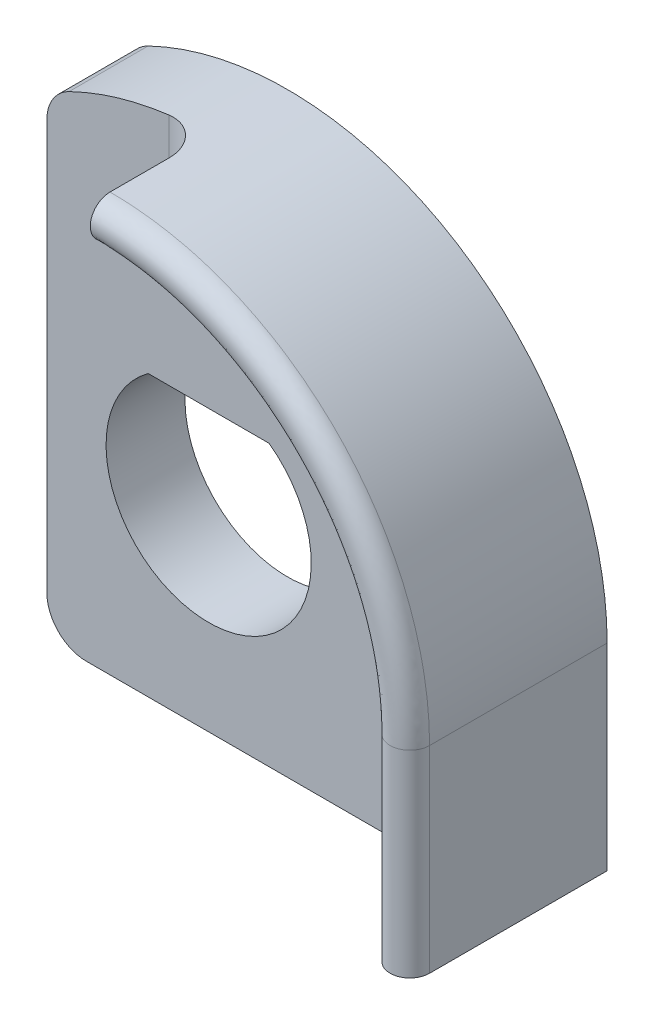
ISO-10303-21;
HEADER;
FILE_DESCRIPTION(('STEP AP214'),'2;1');
FILE_NAME('part.step','',(''),(''),'','','');
FILE_SCHEMA(('AUTOMOTIVE_DESIGN { 1 0 10303 214 1 1 1 1 }'));
ENDSEC;
DATA;
#1=APPLICATION_CONTEXT('core data for automotive mechanical design processes');
#2=APPLICATION_PROTOCOL_DEFINITION('international standard','automotive_design',2000,#1);
#3=PRODUCT_CONTEXT('',#1,'mechanical');
#4=PRODUCT('Part','Part','',(#3));
#5=PRODUCT_RELATED_PRODUCT_CATEGORY('part','',(#4));
#6=PRODUCT_DEFINITION_FORMATION('','',#4);
#7=PRODUCT_DEFINITION_CONTEXT('part definition',#1,'design');
#8=PRODUCT_DEFINITION('design','',#6,#7);
#9=PRODUCT_DEFINITION_SHAPE('','',#8);
#10=(LENGTH_UNIT() NAMED_UNIT(*) SI_UNIT(.MILLI.,.METRE.));
#11=(NAMED_UNIT(*) PLANE_ANGLE_UNIT() SI_UNIT($,.RADIAN.));
#12=(NAMED_UNIT(*) SI_UNIT($,.STERADIAN.) SOLID_ANGLE_UNIT());
#13=UNCERTAINTY_MEASURE_WITH_UNIT(LENGTH_MEASURE(1.E-05),#10,'distance_accuracy_value','');
#14=(GEOMETRIC_REPRESENTATION_CONTEXT(3) GLOBAL_UNCERTAINTY_ASSIGNED_CONTEXT((#13)) GLOBAL_UNIT_ASSIGNED_CONTEXT((#10,
#11,#12)) REPRESENTATION_CONTEXT('',''));
#15=CARTESIAN_POINT('',(0.,0.,0.));
#16=DIRECTION('',(0.,0.,1.));
#17=DIRECTION('',(1.,0.,0.));
#18=AXIS2_PLACEMENT_3D('',#15,#16,#17);
#19=CARTESIAN_POINT('',(7.6,-5.,4.5));
#20=DIRECTION('',(0.,-1.,0.));
#21=DIRECTION('',(0.,0.,-1.));
#22=AXIS2_PLACEMENT_3D('',#19,#20,#21);
#23=CYLINDRICAL_SURFACE('',#22,0.5);
#24=CARTESIAN_POINT('',(7.10000000000001,6.05027027352391E-11,4.49999999999999));
#25=CARTESIAN_POINT('',(7.1,6.05026985607435E-11,4.83333333333332));
#26=CARTESIAN_POINT('',(7.35,6.27418145251573E-11,5.25000000000001));
#27=CARTESIAN_POINT('',(7.85000000000001,6.72200551300588E-11,5.25000000000001));
#28=CARTESIAN_POINT('',(8.10000000000001,6.94591704229849E-11,4.83333333333332));
#29=CARTESIAN_POINT('',(8.1,6.94591670285425E-11,4.49999999999999));
#30=(BOUNDED_CURVE() B_SPLINE_CURVE(5,(#24,#25,#26,#27,#28,#29),.UNSPECIFIED.,.F.,
.F.) B_SPLINE_CURVE_WITH_KNOTS((6,6),(0.,1.),
.UNSPECIFIED.) CURVE() GEOMETRIC_REPRESENTATION_ITEM() RATIONAL_B_SPLINE_CURVE((1.,
0.599999999999993,0.399999999999989,0.399999999999989,0.599999999999993,1.)) REPRESENTATION_ITEM(''));
#31=CARTESIAN_POINT('',(7.1,0.,4.5));
#32=VERTEX_POINT('',#31);
#33=CARTESIAN_POINT('',(8.1,0.,4.5));
#34=VERTEX_POINT('',#33);
#35=EDGE_CURVE('E282',#32,#34,#30,.T.);
#36=ORIENTED_EDGE('',*,*,#35,.F.);
#37=DIRECTION('',(0.,1.,0.));
#38=VECTOR('',#37,1.);
#39=CARTESIAN_POINT('',(7.1,-5.,4.5));
#40=LINE('',#39,#38);
#41=CARTESIAN_POINT('',(7.1,-5.,4.5));
#42=VERTEX_POINT('',#41);
#43=EDGE_CURVE('E197',#42,#32,#40,.T.);
#44=ORIENTED_EDGE('',*,*,#43,.F.);
#45=CARTESIAN_POINT('',(7.6,-5.,4.5));
#46=DIRECTION('',(0.,1.,0.));
#47=DIRECTION('',(0.,0.,1.));
#48=AXIS2_PLACEMENT_3D('',#45,#46,#47);
#49=CIRCLE('',#48,0.5);
#50=CARTESIAN_POINT('',(8.1,-5.,4.5));
#51=VERTEX_POINT('',#50);
#52=EDGE_CURVE('E196',#51,#42,#49,.F.);
#53=ORIENTED_EDGE('',*,*,#52,.F.);
#54=DIRECTION('',(0.,1.,0.));
#55=VECTOR('',#54,1.);
#56=CARTESIAN_POINT('',(8.1,-5.,4.5));
#57=LINE('',#56,#55);
#58=EDGE_CURVE('E193',#34,#51,#57,.F.);
#59=ORIENTED_EDGE('',*,*,#58,.F.);
#60=EDGE_LOOP('',(#36,#44,#53,#59));
#61=FACE_BOUND('',#60,.T.);
#62=ADVANCED_FACE('F38',(#61),#23,.T.);
#63=CARTESIAN_POINT('',(-1.17009575727307,8.01504060618607,4.49754308353227));
#64=CARTESIAN_POINT('',(-0.803731315567237,8.06852523588649,4.49604486390079));
#65=CARTESIAN_POINT('',(-0.427514615194444,8.09999997452948,4.50000000004851));
#66=CARTESIAN_POINT('',(1.06878484894531,8.10000006367625,4.49999999987875));
#67=CARTESIAN_POINT('',(2.12499328446535,7.88746921686769,4.49999998129626));
#68=CARTESIAN_POINT('',(4.07831966162605,7.07778749636161,4.50000001861846));
#69=CARTESIAN_POINT('',(4.97359544530799,6.48153436499398,4.50000000093308));
#70=CARTESIAN_POINT('',(6.48153406867629,4.97359583146588,4.49999999906692));
#71=CARTESIAN_POINT('',(7.07866765627066,4.07690453053062,4.4999999999996));
#72=CARTESIAN_POINT('',(7.8881806780739,2.12256729670818,4.5000000000004));
#73=CARTESIAN_POINT('',(8.1,1.06630263013299,4.4998139233984));
#74=CARTESIAN_POINT('',(8.1,0.,4.5));
#75=CARTESIAN_POINT('',(-1.17009575727307,8.01504060618607,4.83251436117742));
#76=CARTESIAN_POINT('',(-0.802484859657044,8.07082724936822,4.83096012837023));
#77=CARTESIAN_POINT('',(-0.427514615194415,8.09999997706302,4.8333333333495));
#78=CARTESIAN_POINT('',(1.06878484894524,8.1000000573424,4.83333333329292));
#79=CARTESIAN_POINT('',(2.12499328445255,7.8874692168368,4.83333332709916));
#80=CARTESIAN_POINT('',(4.07831966163886,7.0777874963925,4.83333333953908));
#81=CARTESIAN_POINT('',(4.97359547846418,6.48153439815017,4.83333333364409));
#82=CARTESIAN_POINT('',(6.4815340355201,4.97359579830968,4.83333333302258));
#83=CARTESIAN_POINT('',(7.07866765627092,4.07690453053072,4.83333333333333));
#84=CARTESIAN_POINT('',(7.88818067807364,2.12256729670807,4.83333333333333));
#85=CARTESIAN_POINT('',(8.10008271320572,1.06647913005069,4.83321615460348));
#86=CARTESIAN_POINT('',(8.1,0.,4.83333333333333));
#87=CARTESIAN_POINT('',(-1.15694746072875,7.76415644860623,5.25122845823387));
#88=CARTESIAN_POINT('',(-0.786250843680796,7.82192014785471,5.25358159601005));
#89=CARTESIAN_POINT('',(-0.41383589421834,7.84999997721726,5.24999999997559));
#90=CARTESIAN_POINT('',(1.03458809863594,7.8500000569568,5.25000000006103));
#91=CARTESIAN_POINT('',(2.05878617981607,7.64428574443716,5.25000000935187));
#92=CARTESIAN_POINT('',(3.95306084259289,6.85908267048717,5.24999999069077));
#93=CARTESIAN_POINT('',(4.82101719938836,6.28055927150274,5.24999999953407));
#94=CARTESIAN_POINT('',(6.28055893453467,4.82101752383181,5.25000000046594));
#95=CARTESIAN_POINT('',(6.85990406089408,3.95176508824681,5.25000000000081));
#96=CARTESIAN_POINT('',(7.64500451004478,2.05636501592906,5.24999999999919));
#97=CARTESIAN_POINT('',(7.85009306597148,1.03232492322791,5.25012408924923));
#98=CARTESIAN_POINT('',(7.85,0.,5.25));
#99=CARTESIAN_POINT('',(-1.1306508676401,7.26238813344654,5.25122845823387));
#100=CARTESIAN_POINT('',(-0.75686415949416,7.31828435759996,5.25360043641053));
#101=CARTESIAN_POINT('',(-0.386478452266263,7.3499999775251,5.24999999997559));
#102=CARTESIAN_POINT('',(0.966194598017519,7.35000005618723,5.25000000006103));
#103=CARTESIAN_POINT('',(1.92637197054291,7.15791879963908,5.25000000935187));
#104=CARTESIAN_POINT('',(3.70254320450116,6.42167301867529,5.24999999069077));
#105=CARTESIAN_POINT('',(4.51586064123834,5.87860901821068,5.24999999953407));
#106=CARTESIAN_POINT('',(5.8786087325622,4.51586097487326,5.25000000046594));
#107=CARTESIAN_POINT('',(6.4223768701384,3.70148620367958,5.25000000000081));
#108=CARTESIAN_POINT('',(7.15865217398907,1.92396045437044,5.24999999999919));
#109=CARTESIAN_POINT('',(7.34990694587305,0.963575071923958,5.25012407148698));
#110=CARTESIAN_POINT('',(7.35,0.,5.25));
#111=CARTESIAN_POINT('',(-1.11750257109577,7.0115039758667,4.83251436117742));
#112=CARTESIAN_POINT('',(-0.744546077931832,7.06879368173973,4.83093737548443));
#113=CARTESIAN_POINT('',(-0.372799731290261,7.09999997767885,4.8333333333495));
#114=CARTESIAN_POINT('',(0.931997847708399,7.10000005580285,4.83333333329292));
#115=CARTESIAN_POINT('',(1.86016486590644,6.91473532723983,4.83333332709916));
#116=CARTESIAN_POINT('',(3.5772843854552,6.20296819276956,4.83333333953908));
#117=CARTESIAN_POINT('',(4.36328236216293,5.67763389156445,4.83333333364409));
#118=CARTESIAN_POINT('',(5.67763363157637,4.36328270039418,4.83333333302258));
#119=CARTESIAN_POINT('',(6.20361327476197,3.57634676139546,4.83333333333333));
#120=CARTESIAN_POINT('',(6.91547600595981,1.85775817359163,4.83333333333333));
#121=CARTESIAN_POINT('',(7.09991730906867,0.929008012149766,4.83321618825007));
#122=CARTESIAN_POINT('',(7.10000000000001,0.,4.83333333333333));
#123=CARTESIAN_POINT('',(-1.11750257109577,7.0115039758667,4.49754308353227));
#124=CARTESIAN_POINT('',(-0.746454208149433,7.07064214380051,4.49602465234159));
#125=CARTESIAN_POINT('',(-0.37279973129029,7.0999999777893,4.50000000004851));
#126=CARTESIAN_POINT('',(0.931997847708471,7.10000005552673,4.49999999987875));
#127=CARTESIAN_POINT('',(1.86016486591724,6.91473532726589,4.49999998129626));
#128=CARTESIAN_POINT('',(3.57728438544439,6.2029681927435,4.50000001861846));
#129=CARTESIAN_POINT('',(4.36328236214706,5.67763389154859,4.50000000093308));
#130=CARTESIAN_POINT('',(5.67763363159224,4.36328270041004,4.49999999906692));
#131=CARTESIAN_POINT('',(6.20361327476215,3.57634676139553,4.4999999999996));
#132=CARTESIAN_POINT('',(6.91547600595963,1.85775817359156,4.5000000000004));
#133=CARTESIAN_POINT('',(7.1,0.928854372880265,4.49981397680633));
#134=CARTESIAN_POINT('',(7.10000000000001,0.,4.5));
#135=(BOUNDED_SURFACE() B_SPLINE_SURFACE(5,3,((#63,#64,#65,#66,#67,#68,#69,#70,#71,#72,#73,#74),
(#75,#76,#77,#78,#79,#80,#81,#82,#83,#84,#85,#86),(#87,#88,#89,#90,#91,#92,#93,#94,#95,#96,#97,
#98),(#99,#100,#101,#102,#103,#104,#105,#106,#107,#108,#109,#110),(#111,#112,#113,#114,#115,
#116,#117,#118,#119,#120,#121,#122),(#123,#124,#125,#126,#127,#128,#129,#130,#131,#132,#133,
#134)),.UNSPECIFIED.,.F.,.F.,.F.) B_SPLINE_SURFACE_WITH_KNOTS((6,6),(4,2,2,2,2,4),(0.,1.),
(-0.0690453352511078,0.,0.17261333812777,0.34522667625554,0.517840014383309,0.690453352511079),
.UNSPECIFIED.) GEOMETRIC_REPRESENTATION_ITEM() RATIONAL_B_SPLINE_SURFACE(((1.,1.,1.,1.,1.,1.,1.,
1.,1.,1.,1.,1.),(0.599999999999999,0.597458002273395,0.599999999999999,0.599999999999999,
0.599999999999999,0.599999999999999,0.599999999999999,0.599999999999999,0.599999999999999,
0.599999999999999,0.599900730656882,0.599999999999999),(0.399999999999999,0.396187003410071,
0.399999999999999,0.399999999999999,0.399999999999999,0.399999999999999,0.399999999999999,
0.399999999999999,0.399999999999999,0.399999999999999,0.399851095985322,0.399999999999998),
(0.399999999999999,0.396187003410071,0.399999999999999,0.399999999999999,0.399999999999999,
0.399999999999999,0.399999999999999,0.399999999999999,0.399999999999999,0.399999999999999,
0.399851095985322,0.399999999999998),(0.599999999999999,0.597458002273395,0.599999999999999,
0.599999999999999,0.599999999999999,0.599999999999999,0.599999999999999,0.599999999999999,
0.599999999999999,0.599999999999999,0.599900730656882,0.599999999999999),(1.,1.,1.,1.,1.,1.,1.,
1.,1.,1.,1.,1.))) REPRESENTATION_ITEM('') SURFACE());
#136=CARTESIAN_POINT('',(-1.11750257109577,7.0115039758667,4.49754308353227));
#137=CARTESIAN_POINT('',(-0.746454208149433,7.07064214380051,4.49602465234159));
#138=CARTESIAN_POINT('',(-0.37279973129029,7.0999999777893,4.50000000004851));
#139=CARTESIAN_POINT('',(0.931997847708471,7.10000005552673,4.49999999987875));
#140=CARTESIAN_POINT('',(1.86016486591724,6.91473532726589,4.49999998129626));
#141=CARTESIAN_POINT('',(3.57728438544439,6.2029681927435,4.50000001861846));
#142=CARTESIAN_POINT('',(4.36328236214706,5.67763389154859,4.50000000093308));
#143=CARTESIAN_POINT('',(5.67763363159224,4.36328270041004,4.49999999906692));
#144=CARTESIAN_POINT('',(6.20361327476215,3.57634676139553,4.4999999999996));
#145=CARTESIAN_POINT('',(6.91547600595963,1.85775817359156,4.5000000000004));
#146=CARTESIAN_POINT('',(7.1,0.928854372880265,4.49981397680633));
#147=CARTESIAN_POINT('',(7.10000000000001,0.,4.5));
#148=(BOUNDED_CURVE() B_SPLINE_CURVE(3,(#136,#137,#138,#139,#140,#141,#142,#143,#144,#145,#146,
#147),.UNSPECIFIED.,.F.,.F.) B_SPLINE_CURVE_WITH_KNOTS((4,2,2,2,2,4),(-0.0690453352511078,0.,
0.17261333812777,0.34522667625554,0.517840014383309,0.690453352511079),
.UNSPECIFIED.) CURVE() GEOMETRIC_REPRESENTATION_ITEM() RATIONAL_B_SPLINE_CURVE((1.,1.,1.,1.,1.,
1.,1.,1.,1.,1.,1.,1.)) REPRESENTATION_ITEM(''));
#149=CARTESIAN_POINT('',(-4.23004930488373E-07,7.1,4.5));
#150=VERTEX_POINT('',#149);
#151=EDGE_CURVE('E201',#32,#150,#148,.F.);
#152=CARTESIAN_POINT('',(8.1,0.,4.5));
#153=CARTESIAN_POINT('',(8.1,1.06630263013299,4.4998139233984));
#154=CARTESIAN_POINT('',(7.8881806780739,2.12256729670818,4.5000000000004));
#155=CARTESIAN_POINT('',(7.07866765627066,4.07690453053062,4.4999999999996));
#156=CARTESIAN_POINT('',(6.48153406867629,4.97359583146588,4.49999999906692));
#157=CARTESIAN_POINT('',(4.97359544530799,6.48153436499398,4.50000000093308));
#158=CARTESIAN_POINT('',(4.07831966162605,7.07778749636161,4.50000001861846));
#159=CARTESIAN_POINT('',(2.12499328446535,7.88746921686769,4.49999998129626));
#160=CARTESIAN_POINT('',(1.06878484894531,8.10000006367625,4.49999999987875));
#161=CARTESIAN_POINT('',(-0.427514615194444,8.09999997452948,4.50000000004851));
#162=CARTESIAN_POINT('',(-0.803731315567237,8.06852523588649,4.49604486390079));
#163=CARTESIAN_POINT('',(-1.17009575727307,8.01504060618607,4.49754308353227));
#164=(BOUNDED_CURVE() B_SPLINE_CURVE(3,(#152,#153,#154,#155,#156,#157,#158,#159,#160,#161,#162,
#163),.UNSPECIFIED.,.F.,.F.) B_SPLINE_CURVE_WITH_KNOTS((4,2,2,2,2,4),(-0.0690453352511078,
0.103568002876662,0.276181341004432,0.448794679132201,0.621408017259971,0.690453352511079),
.UNSPECIFIED.) CURVE() GEOMETRIC_REPRESENTATION_ITEM() RATIONAL_B_SPLINE_CURVE((1.,1.,1.,1.,1.,
1.,1.,1.,1.,1.,1.,1.)) REPRESENTATION_ITEM(''));
#165=CARTESIAN_POINT('',(-4.23004930456671E-07,8.1,4.5));
#166=VERTEX_POINT('',#165);
#167=EDGE_CURVE('E224',#166,#34,#164,.F.);
#168=CARTESIAN_POINT('',(-4.2300493037797E-07,8.09999999999999,4.5));
#169=CARTESIAN_POINT('',(-4.23320125685617E-07,8.10000003124872,4.50529055504157));
#170=CARTESIAN_POINT('',(-4.23625968289708E-07,8.09991603166266,4.51058111523328));
#171=CARTESIAN_POINT('',(-4.24228890503668E-07,8.09957486331452,4.52132465974252));
#172=CARTESIAN_POINT('',(-4.24525384385588E-07,8.0993122859067,4.52677747276779));
#173=CARTESIAN_POINT('',(-4.25108697939041E-07,8.09859757089192,4.5378441005153));
#174=CARTESIAN_POINT('',(-4.25394913845849E-07,8.09813969326105,4.54345754503474));
#175=CARTESIAN_POINT('',(-4.25956694893505E-07,8.09701711903443,4.55484276280278));
#176=CARTESIAN_POINT('',(-4.26231638213282E-07,8.09634634756341,4.56061393761484));
#177=CARTESIAN_POINT('',(-4.26769845051712E-07,8.09477984247906,4.57231051008608));
#178=CARTESIAN_POINT('',(-4.27032469274239E-07,8.09387769714663,4.5782350496316));
#179=CARTESIAN_POINT('',(-4.275449564243E-07,8.09182950029254,4.59023262092899));
#180=CARTESIAN_POINT('',(-4.27794163344649E-07,8.09067670289937,4.59630450169217));
#181=CARTESIAN_POINT('',(-4.28278687577664E-07,8.08810754746776,4.60858919768263));
#182=CARTESIAN_POINT('',(-4.28513333293998E-07,8.08668411687431,4.61480053450299));
#183=CARTESIAN_POINT('',(-4.2896756513792E-07,8.08355345924982,4.62735454868793));
#184=CARTESIAN_POINT('',(-4.29186465532068E-07,8.0818388462395,4.63369538494379));
#185=CARTESIAN_POINT('',(-4.29608004548808E-07,8.07810517103047,4.64649655582586));
#186=CARTESIAN_POINT('',(-4.29809945198609E-07,8.07607842925029,4.65295465140817));
#187=CARTESIAN_POINT('',(-4.30196340252489E-07,8.07169963284504,4.66597604068579));
#188=CARTESIAN_POINT('',(-4.3038008677072E-07,8.0693396322324,4.67253666322739));
#189=CARTESIAN_POINT('',(-4.30728860074845E-07,8.0642734945223,4.68574614699429));
#190=CARTESIAN_POINT('',(-4.30893171878868E-07,8.06155918031505,4.69239187308111));
#191=CARTESIAN_POINT('',(-4.31201849760845E-07,8.05576393081805,4.70575176092734));
#192=CARTESIAN_POINT('',(-4.31345497109386E-07,8.05267463124979,4.71246229547044));
#193=CARTESIAN_POINT('',(-4.31611645598197E-07,8.04610961450128,4.72592899527952));
#194=CARTESIAN_POINT('',(-4.317334281143E-07,8.04262539886994,4.73268101865853));
#195=CARTESIAN_POINT('',(-4.31954694354375E-07,8.03525184095797,4.74620476770378));
#196=CARTESIAN_POINT('',(-4.32053463954787E-07,8.03135392817968,4.75297182165158));
#197=CARTESIAN_POINT('',(-4.32227624378183E-07,8.02313580258339,4.76649650713354));
#198=CARTESIAN_POINT('',(-4.32302310471645E-07,8.0188070181935,4.7732489314892));
#199=CARTESIAN_POINT('',(-4.32427323752404E-07,8.00971200432218,4.78671202564196));
#200=CARTESIAN_POINT('',(-4.32476960937638E-07,8.00493728127465,4.79341695890104));
#201=CARTESIAN_POINT('',(-4.32551026214003E-07,7.99493780333541,4.80674959493701));
#202=CARTESIAN_POINT('',(-4.32574784730583E-07,7.98970471879875,4.81337105183859));
#203=CARTESIAN_POINT('',(-4.32596403985096E-07,7.97877904615807,4.82649826684742));
#204=CARTESIAN_POINT('',(-4.32593621512036E-07,7.97307838321936,4.83299730573996));
#205=CARTESIAN_POINT('',(-4.32561664411591E-07,7.96121176562259,4.84583847520883));
#206=CARTESIAN_POINT('',(-4.32531878955037E-07,7.95503808430107,4.85217346696631));
#207=CARTESIAN_POINT('',(-4.32445648913258E-07,7.94222388992817,4.86464295108347));
#208=CARTESIAN_POINT('',(-4.32388631790128E-07,7.93557609115238,4.87076995774937));
#209=CARTESIAN_POINT('',(-4.32247930456063E-07,7.92181689990803,4.88277797730572));
#210=CARTESIAN_POINT('',(-4.32163717561589E-07,7.91469875100604,4.8886512500118));
#211=CARTESIAN_POINT('',(-4.31968905644671E-07,7.90000738093007,4.90010498822437));
#212=CARTESIAN_POINT('',(-4.31857826771044E-07,7.8924280130141,4.90567757058231));
#213=CARTESIAN_POINT('',(-4.31609876492222E-07,7.87682832997233,4.91648253810281));
#214=CARTESIAN_POINT('',(-4.31472578148475E-07,7.86880254385282,4.92170702735693));
#215=CARTESIAN_POINT('',(-4.31173121926076E-07,7.85233037443424,4.93176851792089));
#216=CARTESIAN_POINT('',(-4.31010593085806E-07,7.84387925046556,4.93659775395026));
#217=CARTESIAN_POINT('',(-4.30661934296664E-07,7.82658190842363,4.94582296099999));
#218=CARTESIAN_POINT('',(-4.30475490615721E-07,7.81773169381431,4.950211460799));
#219=CARTESIAN_POINT('',(-4.30180328816844E-07,7.80422936097425,4.95641565114468));
#220=CARTESIAN_POINT('',(-4.30078812012269E-07,7.79966737165053,4.9584297210272));
#221=CARTESIAN_POINT('',(-4.29870491072848E-07,7.79045696402508,4.96233246519841));
#222=CARTESIAN_POINT('',(-4.29763658408539E-07,7.78580818784702,4.96422029762221));
#223=CARTESIAN_POINT('',(-4.29544970175108E-07,7.77642942547562,4.9678654883033));
#224=CARTESIAN_POINT('',(-4.29433089541059E-07,7.77169912812803,4.9696220452987));
#225=CARTESIAN_POINT('',(-4.29204585733321E-07,7.76216265107732,4.972999996177));
#226=CARTESIAN_POINT('',(-4.29087940818498E-07,7.75735620391228,4.97462063519967));
#227=CARTESIAN_POINT('',(-4.28850209893254E-07,7.74767315548654,4.97772231274152));
#228=CARTESIAN_POINT('',(-4.28729105330468E-07,7.74279632878842,4.97920264745045));
#229=CARTESIAN_POINT('',(-4.28482774871736E-07,7.73297854808794,4.9820196045638));
#230=CARTESIAN_POINT('',(-4.28357533439107E-07,7.72803740812167,4.98335557887971));
#231=CARTESIAN_POINT('',(-4.28103267200852E-07,7.7180973270149,4.98588004394279));
#232=CARTESIAN_POINT('',(-4.2797422967816E-07,7.71309823652759,4.98706794665749));
#233=CARTESIAN_POINT('',(-4.2771272546478E-07,7.70304884937265,4.98929286654567));
#234=CARTESIAN_POINT('',(-4.27580248651369E-07,7.69799843669677,4.99032935976253));
#235=CARTESIAN_POINT('',(-4.27312235478334E-07,7.68785324371026,4.99224845044617));
#236=CARTESIAN_POINT('',(-4.27176691342552E-07,7.68275837709187,4.99313059166905));
#237=CARTESIAN_POINT('',(-4.26902926299751E-07,7.67253132858336,4.99473838115527));
#238=CARTESIAN_POINT('',(-4.26764699690659E-07,7.66739908611491,4.99546364409951));
#239=CARTESIAN_POINT('',(-4.26485964747646E-07,7.65710452081883,4.99675551110879));
#240=CARTESIAN_POINT('',(-4.2634545249529E-07,7.65194215888063,4.99732180352414));
#241=CARTESIAN_POINT('',(-4.26062551233359E-07,7.6415947388742,4.99829401033985));
#242=CARTESIAN_POINT('',(-4.25920159779796E-07,7.63640965865587,4.99869968900119));
#243=CARTESIAN_POINT('',(-4.25633913286388E-07,7.62602430094031,4.99934940834568));
#244=CARTESIAN_POINT('',(-4.25490056953902E-07,7.62082401355049,4.99959329090842));
#245=CARTESIAN_POINT('',(-4.2520130005634E-07,7.61041581909404,4.99991862641063));
#246=CARTESIAN_POINT('',(-4.2505639901579E-07,7.60520790954702,5.));
#247=CARTESIAN_POINT('',(-4.24765976587415E-07,7.59479209045297,5.));
#248=CARTESIAN_POINT('',(-4.2462045519959E-07,7.58958418090594,4.99991862641063));
#249=CARTESIAN_POINT('',(-4.24329217741094E-07,7.57917598644949,4.99959329090842));
#250=CARTESIAN_POINT('',(-4.24183501800058E-07,7.57397569905967,4.99934940834568));
#251=CARTESIAN_POINT('',(-4.23892301096213E-07,7.56359034134411,4.99869968900119));
#252=CARTESIAN_POINT('',(-4.2374681624652E-07,7.55840526112578,4.99829401033985));
#253=CARTESIAN_POINT('',(-4.23456501880269E-07,7.54805784111936,4.99732180352414));
#254=CARTESIAN_POINT('',(-4.23311671716991E-07,7.54289547918115,4.9967555111088));
#255=CARTESIAN_POINT('',(-4.23023086313848E-07,7.53260091388507,4.99546364409951));
#256=CARTESIAN_POINT('',(-4.22879329532091E-07,7.52746867141663,4.99473838115527));
#257=CARTESIAN_POINT('',(-4.22593304990553E-07,7.51724162290812,4.99313059166905));
#258=CARTESIAN_POINT('',(-4.224510344668E-07,7.51214675628973,4.99224845044617));
#259=CARTESIAN_POINT('',(-4.22168388181357E-07,7.50200156330322,4.99032935976253));
#260=CARTESIAN_POINT('',(-4.22028008122147E-07,7.49695115062734,4.98929286654567));
#261=CARTESIAN_POINT('',(-4.21749538855953E-07,7.48690176347239,4.98706794665749));
#262=CARTESIAN_POINT('',(-4.21611443521645E-07,7.48190267298508,4.98588004394279));
#263=CARTESIAN_POINT('',(-4.21337928170947E-07,7.47196259187831,4.98335557887971));
#264=CARTESIAN_POINT('',(-4.21202499921084E-07,7.46702145191204,4.9820196045638));
#265=CARTESIAN_POINT('',(-4.20934690024008E-07,7.45720367121156,4.97920264745045));
#266=CARTESIAN_POINT('',(-4.20802297782278E-07,7.45232684451344,4.97772231274152));
#267=CARTESIAN_POINT('',(-4.20540916466757E-07,7.44264379608771,4.97462063519967));
#268=CARTESIAN_POINT('',(-4.20411914206421E-07,7.43783734892266,4.972999996177));
#269=CARTESIAN_POINT('',(-4.20157653484907E-07,7.42830087187195,4.9696220452987));
#270=CARTESIAN_POINT('',(-4.20032379038885E-07,7.42357057452436,4.9678654883033));
#271=CARTESIAN_POINT('',(-4.19785896082623E-07,7.41419181215296,4.96422029762221));
#272=CARTESIAN_POINT('',(-4.19664668617159E-07,7.4095430359749,4.96233246519841));
#273=CARTESIAN_POINT('',(-4.19426589150494E-07,7.40033262834945,4.9584297210272));
#274=CARTESIAN_POINT('',(-4.19309715038718E-07,7.39577063902573,4.95641565114468));
#275=CARTESIAN_POINT('',(-4.18967246137729E-07,7.38226830618568,4.950211460799));
#276=CARTESIAN_POINT('',(-4.18747339942836E-07,7.37341809157636,4.94582296099999));
#277=CARTESIAN_POINT('',(-4.1832833865021E-07,7.35612074953443,4.93659775395026));
#278=CARTESIAN_POINT('',(-4.18128986786963E-07,7.34766962556575,4.93176851792089));
#279=CARTESIAN_POINT('',(-4.17752811448761E-07,7.33119745614717,4.92170702735693));
#280=CARTESIAN_POINT('',(-4.17575676223346E-07,7.32317167002766,4.91648253810281));
#281=CARTESIAN_POINT('',(-4.17245337682361E-07,7.30757198698589,4.90567757058231));
#282=CARTESIAN_POINT('',(-4.17091767636044E-07,7.29999261906992,4.90010498822437));
#283=CARTESIAN_POINT('',(-4.1680962063598E-07,7.28530124899394,4.8886512500118));
#284=CARTESIAN_POINT('',(-4.1668062393757E-07,7.27818310009196,4.88277797730572));
#285=CARTESIAN_POINT('',(-4.16448361128252E-07,7.2644239088476,4.87076995774937));
#286=CARTESIAN_POINT('',(-4.16344625355335E-07,7.25777611007181,4.86464295108347));
#287=CARTESIAN_POINT('',(-4.1616331510744E-07,7.24496191569891,4.85217346696631));
#288=CARTESIAN_POINT('',(-4.16085225171824E-07,7.2387882343774,4.84583847520883));
#289=CARTESIAN_POINT('',(-4.159553538082E-07,7.22692161678062,4.83299730573996));
#290=CARTESIAN_POINT('',(-4.15903015984879E-07,7.22122095384191,4.82649826684742));
#291=CARTESIAN_POINT('',(-4.15824539782025E-07,7.21029528120124,4.81337105183859));
#292=CARTESIAN_POINT('',(-4.15797809427641E-07,7.20506219666458,4.80674959493701));
#293=CARTESIAN_POINT('',(-4.15770212976222E-07,7.19506271872534,4.79341695890104));
#294=CARTESIAN_POINT('',(-4.1576872492599E-07,7.1902879956778,4.78671202564196));
#295=CARTESIAN_POINT('',(-4.15791081769318E-07,7.18119298180648,4.7732489314892));
#296=CARTESIAN_POINT('',(-4.158142804047E-07,7.1768641974166,4.76649650713354));
#297=CARTESIAN_POINT('',(-4.15885314678775E-07,7.16864607182031,4.75297182165158));
#298=CARTESIAN_POINT('',(-4.15932485292253E-07,7.16474815904202,4.74620476770378));
#299=CARTESIAN_POINT('',(-4.16050632563035E-07,7.15737460113004,4.73268101865853));
#300=CARTESIAN_POINT('',(-4.16120930718284E-07,7.1538903854987,4.72592899527952));
#301=CARTESIAN_POINT('',(-4.16284395137148E-07,7.14732536875019,4.71246229547044));
#302=CARTESIAN_POINT('',(-4.16376874361912E-07,7.14423606918194,4.70575176092734));
#303=CARTESIAN_POINT('',(-4.16583682730103E-07,7.13844081968494,4.69239187308111));
#304=CARTESIAN_POINT('',(-4.16697320795471E-07,7.13572650547769,4.68574614699429));
#305=CARTESIAN_POINT('',(-4.16945371454294E-07,7.13066036776758,4.67253666322739));
#306=CARTESIAN_POINT('',(-4.17079092976464E-07,7.12830036715494,4.66597604068579));
#307=CARTESIAN_POINT('',(-4.17366199482492E-07,7.12392157074969,4.65295465140817));
#308=CARTESIAN_POINT('',(-4.17518896946986E-07,7.12189482896952,4.64649655582586));
#309=CARTESIAN_POINT('',(-4.17842826728082E-07,7.11816115376048,4.63369538494379));
#310=CARTESIAN_POINT('',(-4.18013378141672E-07,7.11644654075017,4.62735454868793));
#311=CARTESIAN_POINT('',(-4.18371885191924E-07,7.11331588312567,4.61480053450299));
#312=CARTESIAN_POINT('',(-4.1855916914048E-07,7.11189245253222,4.60858919768263));
#313=CARTESIAN_POINT('',(-4.18950022199224E-07,7.10932329710062,4.59630450169217));
#314=CARTESIAN_POINT('',(-4.19152930977742E-07,7.10817049970745,4.59023262092899));
#315=CARTESIAN_POINT('',(-4.19573936369233E-07,7.10612230285336,4.5782350496316));
#316=CARTESIAN_POINT('',(-4.19791385756677E-07,7.10522015752093,4.57231051008608));
#317=CARTESIAN_POINT('',(-4.20240405785612E-07,7.10365365243657,4.56061393761484));
#318=CARTESIAN_POINT('',(-4.20471343674369E-07,7.10298288096555,4.55484276280278));
#319=CARTESIAN_POINT('',(-4.20946312128403E-07,7.10186030673893,4.54345754503474));
#320=CARTESIAN_POINT('',(-4.2118972543167E-07,7.10140242910807,4.5378441005153));
#321=CARTESIAN_POINT('',(-4.2168865568274E-07,7.10068771409329,4.52677747276779));
#322=CARTESIAN_POINT('',(-4.2194357169139E-07,7.10042513668546,4.52132465974252));
#323=CARTESIAN_POINT('',(-4.22464573967273E-07,7.10008396833732,4.51058111523328));
#324=CARTESIAN_POINT('',(-4.2273007581477E-07,7.09999996875126,4.50529055504157));
#325=CARTESIAN_POINT('',(-4.23004930379878E-07,7.1,4.5));
#326=B_SPLINE_CURVE_WITH_KNOTS('',3,(#168,#169,#170,#171,#172,#173,#174,#175,#176,#177,#178,
#179,#180,#181,#182,#183,#184,#185,#186,#187,#188,#189,#190,#191,#192,#193,#194,#195,#196,#197,
#198,#199,#200,#201,#202,#203,#204,#205,#206,#207,#208,#209,#210,#211,#212,#213,#214,#215,#216,
#217,#218,#219,#220,#221,#222,#223,#224,#225,#226,#227,#228,#229,#230,#231,#232,#233,#234,#235,
#236,#237,#238,#239,#240,#241,#242,#243,#244,#245,#246,#247,#248,#249,#250,#251,#252,#253,#254,
#255,#256,#257,#258,#259,#260,#261,#262,#263,#264,#265,#266,#267,#268,#269,#270,#271,#272,#273,
#274,#275,#276,#277,#278,#279,#280,#281,#282,#283,#284,#285,#286,#287,#288,#289,#290,#291,#292,
#293,#294,#295,#296,#297,#298,#299,#300,#301,#302,#303,#304,#305,#306,#307,#308,#309,#310,#311,
#312,#313,#314,#315,#316,#317,#318,#319,#320,#321,#322,#323,#324,#325),.UNSPECIFIED.,.F.,.F.,(4,
2,2,2,2,2,2,2,2,2,2,2,2,2,2,2,2,2,2,2,2,2,2,2,2,2,2,2,2,2,2,2,2,2,2,2,2,2,2,2,2,2,2,2,2,2,2,2,2,
2,2,2,2,2,2,2,2,2,2,2,2,2,2,2,2,2,2,2,2,2,2,2,2,2,2,2,2,2,4),(0.,0.015871016626724,
0.0322454842528009,0.049138532654519,0.0665650798649116,0.0845397035665055,0.103076494832758,
0.122188893235275,0.141889502578389,0.162189886861955,0.183100346520729,0.204629675557262,
0.226784900884035,0.24957100602365,0.272990642280279,0.297043831578065,0.321727666336882,
0.347036012982368,0.37295922690835,0.399483887851235,0.426592565607551,0.454263626725213,
0.482471093116856,0.511184563373526,0.540369206806277,0.569985838845931,0.584944426807618,
0.599994462432076,0.615129909206951,0.630344505518209,0.645631777649353,0.660985054140777,
0.676397481446951,0.691862040813629,0.707371566282574,0.722918763717318,0.738496230730358,
0.754096477380739,0.769711947500612,0.785335040501153,0.800958133501694,0.816573603621569,
0.832173850271949,0.84775131728499,0.863298514719729,0.878808040188675,0.894272599555354,
0.909685026861531,0.925038303352955,0.9403255754841,0.955540171795358,0.970675618570229,
0.985725654194691,1.00068424215637,1.03030087419602,1.05948551762878,1.08819898788545,
1.11640645427709,1.14407751539476,1.17118619315107,1.19771085409396,1.22363406801994,
1.24894241466542,1.27362624942424,1.29767943872203,1.32109907497866,1.34388518011827,
1.36604040544504,1.38756973448158,1.40848019414035,1.42878057842392,1.44848118776703,
1.46759358616955,1.4861303774358,1.50410500113739,1.52153154834779,1.5384245967495,
1.55479906437558,1.57067008100231),.UNSPECIFIED.);
#327=EDGE_CURVE('E270',#150,#166,#326,.F.);
#328=ORIENTED_EDGE('',*,*,#151,.F.);
#329=ORIENTED_EDGE('',*,*,#35,.T.);
#330=ORIENTED_EDGE('',*,*,#167,.F.);
#331=ORIENTED_EDGE('',*,*,#327,.F.);
#332=EDGE_LOOP('',(#328,#329,#330,#331));
#333=FACE_BOUND('',#332,.T.);
#334=ADVANCED_FACE('F241',(#333),#135,.T.);
#335=CARTESIAN_POINT('',(0.,0.,2.));
#336=DIRECTION('',(0.,0.,-1.));
#337=DIRECTION('',(-1.,0.,0.));
#338=AXIS2_PLACEMENT_3D('',#335,#336,#337);
#339=CYLINDRICAL_SURFACE('',#338,8.1);
#340=CARTESIAN_POINT('',(0.,0.,0.));
#341=DIRECTION('',(0.,0.,1.));
#342=DIRECTION('',(1.,0.,0.));
#343=AXIS2_PLACEMENT_3D('',#340,#341,#342);
#344=CIRCLE('',#343,8.1);
#345=CARTESIAN_POINT('',(8.1,0.,0.));
#346=VERTEX_POINT('',#345);
#347=CARTESIAN_POINT('',(-3.53661971830986,7.28713393372606,0.));
#348=VERTEX_POINT('',#347);
#349=EDGE_CURVE('E157',#346,#348,#344,.T.);
#350=ORIENTED_EDGE('',*,*,#349,.T.);
#351=DIRECTION('',(0.,0.,-1.));
#352=VECTOR('',#351,1.);
#353=CARTESIAN_POINT('',(-3.53661971830986,7.28713393372606,2.));
#354=LINE('',#353,#352);
#355=CARTESIAN_POINT('',(-3.53661971830986,7.28713393372606,2.));
#356=VERTEX_POINT('',#355);
#357=EDGE_CURVE('E297',#348,#356,#354,.F.);
#358=ORIENTED_EDGE('',*,*,#357,.T.);
#359=CARTESIAN_POINT('',(0.,0.,2.));
#360=DIRECTION('',(0.,0.,1.));
#361=DIRECTION('',(1.,0.,0.));
#362=AXIS2_PLACEMENT_3D('',#359,#360,#361);
#363=CIRCLE('',#362,8.1);
#364=CARTESIAN_POINT('',(-1.00000042300493,8.038034533018,2.));
#365=VERTEX_POINT('',#364);
#366=EDGE_CURVE('E171',#365,#356,#363,.T.);
#367=ORIENTED_EDGE('',*,*,#366,.F.);
#368=CARTESIAN_POINT('',(-1.00000042300493,8.038034533018,2.));
#369=CARTESIAN_POINT('',(-0.972101375638921,8.04150621577208,2.00000017859674));
#370=CARTESIAN_POINT('',(-0.944196757735581,8.04482929711534,2.00116831944128));
#371=CARTESIAN_POINT('',(-0.888548081695459,8.05116543305114,2.00583759419749));
#372=CARTESIAN_POINT('',(-0.860804023793809,8.05417848718977,2.00933873152485));
#373=CARTESIAN_POINT('',(-0.778155796337898,8.06272452441184,2.02332278099583));
#374=CARTESIAN_POINT('',(-0.723748084259281,8.06777521489436,2.03728636053456));
#375=CARTESIAN_POINT('',(-0.617929828022167,8.07657055671835,2.07416633461032));
#376=CARTESIAN_POINT('',(-0.566521474139887,8.08031426333818,2.09708917987347));
#377=CARTESIAN_POINT('',(-0.468223676610687,8.0866057430956,2.15125975784697));
#378=CARTESIAN_POINT('',(-0.421333088732712,8.08915381969086,2.18250537503108));
#379=CARTESIAN_POINT('',(-0.333608543126571,8.09324597532633,2.25230211434049));
#380=CARTESIAN_POINT('',(-0.292751204863094,8.09479401301479,2.2908236418026));
#381=CARTESIAN_POINT('',(-0.218030726173445,8.09715157178376,2.37417560045352));
#382=CARTESIAN_POINT('',(-0.184169164080484,8.09796092634871,2.41900745150152));
#383=CARTESIAN_POINT('',(-0.124359341586468,8.09910084971538,2.51378997256735));
#384=CARTESIAN_POINT('',(-0.0984262121698606,8.09943050749196,2.56375019017346));
#385=CARTESIAN_POINT('',(-0.055304063085049,8.09984006410493,2.66729923694938));
#386=CARTESIAN_POINT('',(-0.0381102493979414,8.09992009999737,2.72088605839598));
#387=CARTESIAN_POINT('',(-0.0170449687221311,8.09998652047272,2.81230895623272));
#388=CARTESIAN_POINT('',(-0.0106577467654531,8.09999492869662,2.84958514864596));
#389=CARTESIAN_POINT('',(-0.00213558496407869,8.10000002089003,2.92456912547694));
#390=CARTESIAN_POINT('',(5.1091562352246E-06,8.09999672074196,2.96227625612423));
#391=CARTESIAN_POINT('',(-4.23004930567477E-07,8.09999999999999,3.));
#392=B_SPLINE_CURVE_WITH_KNOTS('',3,(#368,#369,#370,#371,#372,#373,#374,#375,#376,#377,#378,
#379,#380,#381,#382,#383,#384,#385,#386,#387,#388,#389,#390,#391),.UNSPECIFIED.,.F.,.F.,(4,2,2,
2,2,2,2,2,2,2,2,4),(0.,0.0842921597687177,0.168584442947809,0.336907887101727,0.505352749090578,
0.673754835663098,0.84148615114455,1.00925526764977,1.17734259202905,1.34533761103087,
1.45856945993471,1.57164776844369),.UNSPECIFIED.);
#393=CARTESIAN_POINT('',(-4.23004930456671E-07,8.1,3.));
#394=VERTEX_POINT('',#393);
#395=EDGE_CURVE('E11',#365,#394,#392,.T.);
#396=ORIENTED_EDGE('',*,*,#395,.T.);
#397=DIRECTION('',(0.,0.,-1.));
#398=VECTOR('',#397,1.);
#399=CARTESIAN_POINT('',(-4.23004930456671E-07,8.1,5.));
#400=LINE('',#399,#398);
#401=EDGE_CURVE('E206',#166,#394,#400,.T.);
#402=ORIENTED_EDGE('',*,*,#401,.F.);
#403=ORIENTED_EDGE('',*,*,#167,.T.);
#404=DIRECTION('',(0.,0.,-1.));
#405=VECTOR('',#404,1.);
#406=CARTESIAN_POINT('',(8.1,0.,2.));
#407=LINE('',#406,#405);
#408=EDGE_CURVE('E177',#34,#346,#407,.T.);
#409=ORIENTED_EDGE('',*,*,#408,.T.);
#410=EDGE_LOOP('',(#350,#358,#367,#396,#402,#403,#409));
#411=FACE_BOUND('',#410,.T.);
#412=ADVANCED_FACE('F230',(#411),#339,.T.);
#413=CARTESIAN_POINT('',(-8.1,-5.,2.));
#414=DIRECTION('',(0.,1.,0.));
#415=DIRECTION('',(0.,0.,1.));
#416=AXIS2_PLACEMENT_3D('',#413,#414,#415);
#417=PLANE('',#416);
#418=DIRECTION('',(1.,0.,0.));
#419=VECTOR('',#418,1.);
#420=CARTESIAN_POINT('',(-8.1,-5.,2.));
#421=LINE('',#420,#419);
#422=CARTESIAN_POINT('',(-3.1,-5.,2.));
#423=VERTEX_POINT('',#422);
#424=CARTESIAN_POINT('',(7.1,-5.,2.));
#425=VERTEX_POINT('',#424);
#426=EDGE_CURVE('E174',#423,#425,#421,.T.);
#427=ORIENTED_EDGE('',*,*,#426,.F.);
#428=DIRECTION('',(0.,0.,1.));
#429=VECTOR('',#428,1.);
#430=CARTESIAN_POINT('',(-3.1,-5.,2.));
#431=LINE('',#430,#429);
#432=CARTESIAN_POINT('',(-3.1,-5.,0.));
#433=VERTEX_POINT('',#432);
#434=EDGE_CURVE('E291',#423,#433,#431,.F.);
#435=ORIENTED_EDGE('',*,*,#434,.T.);
#436=DIRECTION('',(1.,0.,0.));
#437=VECTOR('',#436,1.);
#438=CARTESIAN_POINT('',(-8.1,-5.,0.));
#439=LINE('',#438,#437);
#440=CARTESIAN_POINT('',(8.1,-5.,0.));
#441=VERTEX_POINT('',#440);
#442=EDGE_CURVE('E180',#433,#441,#439,.T.);
#443=ORIENTED_EDGE('',*,*,#442,.T.);
#444=DIRECTION('',(0.,0.,-1.));
#445=VECTOR('',#444,1.);
#446=CARTESIAN_POINT('',(8.1,-5.,2.));
#447=LINE('',#446,#445);
#448=EDGE_CURVE('E186',#51,#441,#447,.T.);
#449=ORIENTED_EDGE('',*,*,#448,.F.);
#450=ORIENTED_EDGE('',*,*,#52,.T.);
#451=DIRECTION('',(0.,0.,-1.));
#452=VECTOR('',#451,1.);
#453=CARTESIAN_POINT('',(7.1,-5.,5.));
#454=LINE('',#453,#452);
#455=EDGE_CURVE('E383',#42,#425,#454,.T.);
#456=ORIENTED_EDGE('',*,*,#455,.T.);
#457=EDGE_LOOP('',(#427,#435,#443,#449,#450,#456));
#458=FACE_BOUND('',#457,.T.);
#459=ADVANCED_FACE('F240',(#458),#417,.F.);
#460=CARTESIAN_POINT('',(8.1,0.,2.));
#461=DIRECTION('',(-1.,0.,0.));
#462=DIRECTION('',(0.,0.,1.));
#463=AXIS2_PLACEMENT_3D('',#460,#461,#462);
#464=PLANE('',#463);
#465=ORIENTED_EDGE('',*,*,#408,.F.);
#466=ORIENTED_EDGE('',*,*,#58,.T.);
#467=ORIENTED_EDGE('',*,*,#448,.T.);
#468=DIRECTION('',(0.,1.,0.));
#469=VECTOR('',#468,1.);
#470=CARTESIAN_POINT('',(8.1,0.,0.));
#471=LINE('',#470,#469);
#472=EDGE_CURVE('E175',#441,#346,#471,.T.);
#473=ORIENTED_EDGE('',*,*,#472,.T.);
#474=EDGE_LOOP('',(#465,#466,#467,#473));
#475=FACE_BOUND('',#474,.T.);
#476=ADVANCED_FACE('F394',(#475),#464,.F.);
#477=CARTESIAN_POINT('',(0.,0.,2.));
#478=DIRECTION('',(0.,0.,1.));
#479=DIRECTION('',(1.,0.,0.));
#480=AXIS2_PLACEMENT_3D('',#477,#478,#479);
#481=PLANE('',#480);
#482=DIRECTION('',(0.,1.,0.));
#483=VECTOR('',#482,1.);
#484=CARTESIAN_POINT('',(-4.1,-5.,2.));
#485=LINE('',#484,#483);
#486=CARTESIAN_POINT('',(-4.1,-4.,2.));
#487=VERTEX_POINT('',#486);
#488=CARTESIAN_POINT('',(-4.1,6.38748776906853,2.));
#489=VERTEX_POINT('',#488);
#490=EDGE_CURVE('E165',#487,#489,#485,.T.);
#491=ORIENTED_EDGE('',*,*,#490,.F.);
#492=CARTESIAN_POINT('',(-3.1,-4.,2.));
#493=DIRECTION('',(0.,0.,1.));
#494=DIRECTION('',(1.,0.,0.));
#495=AXIS2_PLACEMENT_3D('',#492,#493,#494);
#496=CIRCLE('',#495,1.);
#497=EDGE_CURVE('E289',#487,#423,#496,.T.);
#498=ORIENTED_EDGE('',*,*,#497,.T.);
#499=ORIENTED_EDGE('',*,*,#426,.T.);
#500=DIRECTION('',(0.,-1.,0.));
#501=VECTOR('',#500,1.);
#502=CARTESIAN_POINT('',(7.1,-5.,2.));
#503=LINE('',#502,#501);
#504=CARTESIAN_POINT('',(7.1,0.,2.));
#505=VERTEX_POINT('',#504);
#506=EDGE_CURVE('E387',#505,#425,#503,.T.);
#507=ORIENTED_EDGE('',*,*,#506,.F.);
#508=CARTESIAN_POINT('',(0.,0.,2.));
#509=DIRECTION('',(0.,0.,-1.));
#510=DIRECTION('',(1.,0.,0.));
#511=AXIS2_PLACEMENT_3D('',#508,#509,#510);
#512=CIRCLE('',#511,7.10000000000003);
#513=CARTESIAN_POINT('',(-1.00000042300493,7.02922464813795,2.));
#514=VERTEX_POINT('',#513);
#515=EDGE_CURVE('E363',#514,#505,#512,.T.);
#516=ORIENTED_EDGE('',*,*,#515,.F.);
#517=DIRECTION('',(0.,-1.,0.));
#518=VECTOR('',#517,1.);
#519=CARTESIAN_POINT('',(-1.00000042300493,0.,2.));
#520=LINE('',#519,#518);
#521=EDGE_CURVE('E285',#514,#365,#520,.F.);
#522=ORIENTED_EDGE('',*,*,#521,.T.);
#523=ORIENTED_EDGE('',*,*,#366,.T.);
#524=CARTESIAN_POINT('',(-3.1,6.38748776906852,2.));
#525=DIRECTION('',(0.,0.,1.));
#526=DIRECTION('',(1.,0.,0.));
#527=AXIS2_PLACEMENT_3D('',#524,#525,#526);
#528=CIRCLE('',#527,1.);
#529=EDGE_CURVE('E287',#356,#489,#528,.T.);
#530=ORIENTED_EDGE('',*,*,#529,.T.);
#531=EDGE_LOOP('',(#491,#498,#499,#507,#516,#522,#523,#530));
#532=FACE_BOUND('',#531,.T.);
#533=CARTESIAN_POINT('',(0.,0.,2.));
#534=DIRECTION('',(0.,0.,1.));
#535=DIRECTION('',(1.,0.,0.));
#536=AXIS2_PLACEMENT_3D('',#533,#534,#535);
#537=CIRCLE('',#536,2.6);
#538=CARTESIAN_POINT('',(-1.53297097167559,2.1,2.));
#539=VERTEX_POINT('',#538);
#540=CARTESIAN_POINT('',(1.53297097167559,2.1,2.));
#541=VERTEX_POINT('',#540);
#542=EDGE_CURVE('E146',#539,#541,#537,.T.);
#543=ORIENTED_EDGE('',*,*,#542,.F.);
#544=DIRECTION('',(-1.,0.,0.));
#545=VECTOR('',#544,1.);
#546=CARTESIAN_POINT('',(-1.53297097167559,2.1,2.));
#547=LINE('',#546,#545);
#548=EDGE_CURVE('E151',#541,#539,#547,.T.);
#549=ORIENTED_EDGE('',*,*,#548,.F.);
#550=EDGE_LOOP('',(#543,#549));
#551=FACE_BOUND('',#550,.T.);
#552=ADVANCED_FACE('F360',(#532,#551),#481,.T.);
#553=CARTESIAN_POINT('',(0.,0.,0.));
#554=DIRECTION('',(0.,0.,1.));
#555=DIRECTION('',(1.,0.,0.));
#556=AXIS2_PLACEMENT_3D('',#553,#554,#555);
#557=PLANE('',#556);
#558=DIRECTION('',(1.,0.,0.));
#559=VECTOR('',#558,1.);
#560=CARTESIAN_POINT('',(-1.53297097167559,2.1,0.));
#561=LINE('',#560,#559);
#562=CARTESIAN_POINT('',(-1.53297097167559,2.1,0.));
#563=VERTEX_POINT('',#562);
#564=CARTESIAN_POINT('',(1.53297097167559,2.1,0.));
#565=VERTEX_POINT('',#564);
#566=EDGE_CURVE('E154',#563,#565,#561,.T.);
#567=ORIENTED_EDGE('',*,*,#566,.F.);
#568=CARTESIAN_POINT('',(0.,0.,0.));
#569=DIRECTION('',(0.,0.,1.));
#570=DIRECTION('',(1.,0.,0.));
#571=AXIS2_PLACEMENT_3D('',#568,#569,#570);
#572=CIRCLE('',#571,2.6);
#573=EDGE_CURVE('E143',#565,#563,#572,.F.);
#574=ORIENTED_EDGE('',*,*,#573,.F.);
#575=EDGE_LOOP('',(#567,#574));
#576=FACE_BOUND('',#575,.T.);
#577=ORIENTED_EDGE('',*,*,#442,.F.);
#578=CARTESIAN_POINT('',(-3.1,-4.,0.));
#579=DIRECTION('',(0.,0.,1.));
#580=DIRECTION('',(1.,0.,0.));
#581=AXIS2_PLACEMENT_3D('',#578,#579,#580);
#582=CIRCLE('',#581,1.);
#583=CARTESIAN_POINT('',(-4.1,-4.,0.));
#584=VERTEX_POINT('',#583);
#585=EDGE_CURVE('E295',#433,#584,#582,.F.);
#586=ORIENTED_EDGE('',*,*,#585,.T.);
#587=DIRECTION('',(0.,-1.,0.));
#588=VECTOR('',#587,1.);
#589=CARTESIAN_POINT('',(-4.1,-5.,0.));
#590=LINE('',#589,#588);
#591=CARTESIAN_POINT('',(-4.1,6.38748776906853,0.));
#592=VERTEX_POINT('',#591);
#593=EDGE_CURVE('E161',#592,#584,#590,.T.);
#594=ORIENTED_EDGE('',*,*,#593,.F.);
#595=CARTESIAN_POINT('',(-3.1,6.38748776906852,0.));
#596=DIRECTION('',(0.,0.,1.));
#597=DIRECTION('',(1.,0.,0.));
#598=AXIS2_PLACEMENT_3D('',#595,#596,#597);
#599=CIRCLE('',#598,1.);
#600=EDGE_CURVE('E293',#592,#348,#599,.F.);
#601=ORIENTED_EDGE('',*,*,#600,.T.);
#602=ORIENTED_EDGE('',*,*,#349,.F.);
#603=ORIENTED_EDGE('',*,*,#472,.F.);
#604=EDGE_LOOP('',(#577,#586,#594,#601,#602,#603));
#605=FACE_BOUND('',#604,.T.);
#606=ADVANCED_FACE('F159',(#576,#605),#557,.F.);
#607=CARTESIAN_POINT('',(0.,0.,-0.00100000000000013));
#608=DIRECTION('',(0.,0.,1.));
#609=DIRECTION('',(1.,0.,0.));
#610=AXIS2_PLACEMENT_3D('',#607,#608,#609);
#611=CYLINDRICAL_SURFACE('',#610,2.6);
#612=ORIENTED_EDGE('',*,*,#573,.T.);
#613=DIRECTION('',(0.,0.,1.));
#614=VECTOR('',#613,1.);
#615=CARTESIAN_POINT('',(-1.53297097167559,2.1,-0.00100000000000013));
#616=LINE('',#615,#614);
#617=EDGE_CURVE('E150',#563,#539,#616,.T.);
#618=ORIENTED_EDGE('',*,*,#617,.T.);
#619=ORIENTED_EDGE('',*,*,#542,.T.);
#620=DIRECTION('',(0.,0.,1.));
#621=VECTOR('',#620,1.);
#622=CARTESIAN_POINT('',(1.53297097167559,2.1,-0.00100000000000013));
#623=LINE('',#622,#621);
#624=EDGE_CURVE('E139',#565,#541,#623,.T.);
#625=ORIENTED_EDGE('',*,*,#624,.F.);
#626=EDGE_LOOP('',(#612,#618,#619,#625));
#627=FACE_BOUND('',#626,.T.);
#628=ADVANCED_FACE('F141',(#627),#611,.F.);
#629=CARTESIAN_POINT('',(-1.53297097167559,2.1,-0.00100000000000013));
#630=DIRECTION('',(0.,1.,0.));
#631=DIRECTION('',(0.,0.,1.));
#632=AXIS2_PLACEMENT_3D('',#629,#630,#631);
#633=PLANE('',#632);
#634=ORIENTED_EDGE('',*,*,#566,.T.);
#635=ORIENTED_EDGE('',*,*,#624,.T.);
#636=ORIENTED_EDGE('',*,*,#548,.T.);
#637=ORIENTED_EDGE('',*,*,#617,.F.);
#638=EDGE_LOOP('',(#634,#635,#636,#637));
#639=FACE_BOUND('',#638,.T.);
#640=ADVANCED_FACE('F155',(#639),#633,.F.);
#641=CARTESIAN_POINT('',(-4.1,-5.,-0.00100000000000013));
#642=DIRECTION('',(1.,0.,0.));
#643=DIRECTION('',(0.,1.,0.));
#644=AXIS2_PLACEMENT_3D('',#641,#642,#643);
#645=PLANE('',#644);
#646=ORIENTED_EDGE('',*,*,#593,.T.);
#647=DIRECTION('',(0.,0.,1.));
#648=VECTOR('',#647,1.);
#649=CARTESIAN_POINT('',(-4.1,-4.,-0.00100000000000013));
#650=LINE('',#649,#648);
#651=EDGE_CURVE('E281',#584,#487,#650,.T.);
#652=ORIENTED_EDGE('',*,*,#651,.T.);
#653=ORIENTED_EDGE('',*,*,#490,.T.);
#654=DIRECTION('',(0.,0.,-1.));
#655=VECTOR('',#654,1.);
#656=CARTESIAN_POINT('',(-4.1,6.38748776906853,-0.00100000000000013));
#657=LINE('',#656,#655);
#658=EDGE_CURVE('E274',#489,#592,#657,.T.);
#659=ORIENTED_EDGE('',*,*,#658,.T.);
#660=EDGE_LOOP('',(#646,#652,#653,#659));
#661=FACE_BOUND('',#660,.T.);
#662=ADVANCED_FACE('F317',(#661),#645,.F.);
#663=CARTESIAN_POINT('',(-4.23004930456671E-07,7.1,5.));
#664=DIRECTION('',(1.,0.,0.));
#665=DIRECTION('',(0.,0.,-1.));
#666=AXIS2_PLACEMENT_3D('',#663,#664,#665);
#667=PLANE('',#666);
#668=ORIENTED_EDGE('',*,*,#401,.T.);
#669=DIRECTION('',(0.,-1.,0.));
#670=VECTOR('',#669,1.);
#671=CARTESIAN_POINT('',(-4.23004930456671E-07,7.1,3.));
#672=LINE('',#671,#670);
#673=CARTESIAN_POINT('',(-4.23004930488373E-07,7.1,3.));
#674=VERTEX_POINT('',#673);
#675=EDGE_CURVE('E300',#394,#674,#672,.T.);
#676=ORIENTED_EDGE('',*,*,#675,.T.);
#677=DIRECTION('',(0.,0.,-1.));
#678=VECTOR('',#677,1.);
#679=CARTESIAN_POINT('',(-4.23004930488373E-07,7.1,5.));
#680=LINE('',#679,#678);
#681=EDGE_CURVE('E202',#150,#674,#680,.T.);
#682=ORIENTED_EDGE('',*,*,#681,.F.);
#683=ORIENTED_EDGE('',*,*,#327,.T.);
#684=EDGE_LOOP('',(#668,#676,#682,#683));
#685=FACE_BOUND('',#684,.T.);
#686=ADVANCED_FACE('F311',(#685),#667,.F.);
#687=CARTESIAN_POINT('',(0.,0.,5.));
#688=DIRECTION('',(0.,0.,-1.));
#689=DIRECTION('',(-1.,0.,0.));
#690=AXIS2_PLACEMENT_3D('',#687,#688,#689);
#691=CYLINDRICAL_SURFACE('',#690,7.10000000000003);
#692=DIRECTION('',(0.,0.,-1.));
#693=VECTOR('',#692,1.);
#694=CARTESIAN_POINT('',(7.1,0.,5.));
#695=LINE('',#694,#693);
#696=EDGE_CURVE('E207',#32,#505,#695,.T.);
#697=ORIENTED_EDGE('',*,*,#696,.F.);
#698=ORIENTED_EDGE('',*,*,#151,.T.);
#699=ORIENTED_EDGE('',*,*,#681,.T.);
#700=CARTESIAN_POINT('',(-4.23004930456671E-07,7.1,3.));
#701=CARTESIAN_POINT('',(-6.10816639312335E-07,7.0999990373361,2.97187076859084));
#702=CARTESIAN_POINT('',(-0.001188048031488,7.10000010815525,2.94375501169066));
#703=CARTESIAN_POINT('',(-0.00592522593722319,7.09999811025327,2.88772458857546));
#704=CARTESIAN_POINT('',(-0.00947485528842255,7.09999504172724,2.85980991294535));
#705=CARTESIAN_POINT('',(-0.0236336496349712,7.09996734910892,2.77671426325268));
#706=CARTESIAN_POINT('',(-0.0377528121910084,7.09992428780578,2.72208970709237));
#707=CARTESIAN_POINT('',(-0.0749596322372967,7.09962837771154,2.61598696326209));
#708=CARTESIAN_POINT('',(-0.0980516923708253,7.09937542586624,2.56451033452715));
#709=CARTESIAN_POINT('',(-0.152544988936183,7.09841318026255,2.46616770177212));
#710=CARTESIAN_POINT('',(-0.18394478710036,7.09770396546378,2.41930090160545));
#711=CARTESIAN_POINT('',(-0.254125154110538,7.09553719833471,2.33155064861236));
#712=CARTESIAN_POINT('',(-0.292899510934991,7.0940802741019,2.29066221077206));
#713=CARTESIAN_POINT('',(-0.376731784592087,7.09012199205589,2.21598021014676));
#714=CARTESIAN_POINT('',(-0.421790407125123,7.0876205168804,2.18218744524959));
#715=CARTESIAN_POINT('',(-0.516704974789181,7.08133238928699,2.1227591115278));
#716=CARTESIAN_POINT('',(-0.566544618728303,7.07754999991603,2.09709702413726));
#717=CARTESIAN_POINT('',(-0.669687208696361,7.06853535557261,2.05448286955469));
#718=CARTESIAN_POINT('',(-0.722988589138746,7.06330375256617,2.03752689545886));
#719=CARTESIAN_POINT('',(-0.81383139574795,7.05329979658462,2.01676317072132));
#720=CARTESIAN_POINT('',(-0.850870472114588,7.04892989936215,2.01047385753547));
#721=CARTESIAN_POINT('',(-0.925283540156872,7.03955039070388,2.00209247272177));
#722=CARTESIAN_POINT('',(-0.962656946010287,7.03454174883463,1.99999411833948));
#723=CARTESIAN_POINT('',(-1.00000042300493,7.02922464813795,2.));
#724=B_SPLINE_CURVE_WITH_KNOTS('',3,(#700,#701,#702,#703,#704,#705,#706,#707,#708,#709,#710,
#711,#712,#713,#714,#715,#716,#717,#718,#719,#720,#721,#722,#723),.UNSPECIFIED.,.F.,.F.,(4,2,2,
2,2,2,2,2,2,2,2,4),(0.,0.0843358737167223,0.168667772623501,0.337059202572278,0.505533360028831,
0.673978369652742,0.84228211165303,1.0106047687976,1.1783726438134,1.34606516636729,
1.45930759227977,1.57238012628446),.UNSPECIFIED.);
#725=EDGE_CURVE('E52',#674,#514,#724,.T.);
#726=ORIENTED_EDGE('',*,*,#725,.T.);
#727=ORIENTED_EDGE('',*,*,#515,.T.);
#728=EDGE_LOOP('',(#697,#698,#699,#726,#727));
#729=FACE_BOUND('',#728,.T.);
#730=ADVANCED_FACE('F305',(#729),#691,.F.);
#731=CARTESIAN_POINT('',(7.1,-5.,5.));
#732=DIRECTION('',(1.,0.,0.));
#733=DIRECTION('',(0.,0.,-1.));
#734=AXIS2_PLACEMENT_3D('',#731,#732,#733);
#735=PLANE('',#734);
#736=ORIENTED_EDGE('',*,*,#455,.F.);
#737=ORIENTED_EDGE('',*,*,#43,.T.);
#738=ORIENTED_EDGE('',*,*,#696,.T.);
#739=ORIENTED_EDGE('',*,*,#506,.T.);
#740=EDGE_LOOP('',(#736,#737,#738,#739));
#741=FACE_BOUND('',#740,.T.);
#742=ADVANCED_FACE('F310',(#741),#735,.F.);
#743=CARTESIAN_POINT('',(-3.1,-4.,-0.00100000000000013));
#744=DIRECTION('',(0.,0.,1.));
#745=DIRECTION('',(1.,0.,0.));
#746=AXIS2_PLACEMENT_3D('',#743,#744,#745);
#747=CYLINDRICAL_SURFACE('',#746,1.);
#748=ORIENTED_EDGE('',*,*,#585,.F.);
#749=ORIENTED_EDGE('',*,*,#434,.F.);
#750=ORIENTED_EDGE('',*,*,#497,.F.);
#751=ORIENTED_EDGE('',*,*,#651,.F.);
#752=EDGE_LOOP('',(#748,#749,#750,#751));
#753=FACE_BOUND('',#752,.T.);
#754=ADVANCED_FACE('F376',(#753),#747,.T.);
#755=CARTESIAN_POINT('',(-3.1,6.38748776906852,2.));
#756=DIRECTION('',(0.,0.,-1.));
#757=DIRECTION('',(-1.,0.,0.));
#758=AXIS2_PLACEMENT_3D('',#755,#756,#757);
#759=CYLINDRICAL_SURFACE('',#758,1.);
#760=ORIENTED_EDGE('',*,*,#600,.F.);
#761=ORIENTED_EDGE('',*,*,#658,.F.);
#762=ORIENTED_EDGE('',*,*,#529,.F.);
#763=ORIENTED_EDGE('',*,*,#357,.F.);
#764=EDGE_LOOP('',(#760,#761,#762,#763));
#765=FACE_BOUND('',#764,.T.);
#766=ADVANCED_FACE('F368',(#765),#759,.T.);
#767=CARTESIAN_POINT('',(-1.00000042300493,7.1,3.));
#768=DIRECTION('',(0.,-1.,0.));
#769=DIRECTION('',(0.,0.,-1.));
#770=AXIS2_PLACEMENT_3D('',#767,#768,#769);
#771=CYLINDRICAL_SURFACE('',#770,1.);
#772=ORIENTED_EDGE('',*,*,#395,.F.);
#773=ORIENTED_EDGE('',*,*,#521,.F.);
#774=ORIENTED_EDGE('',*,*,#725,.F.);
#775=ORIENTED_EDGE('',*,*,#675,.F.);
#776=EDGE_LOOP('',(#772,#773,#774,#775));
#777=FACE_BOUND('',#776,.T.);
#778=ADVANCED_FACE('F40',(#777),#771,.F.);
#779=CLOSED_SHELL('',(#62,#334,#412,#459,#476,#552,#606,#628,#640,#662,#686,#730,#742,#754,#766,#778));
#780=MANIFOLD_SOLID_BREP('B2',#779);
#781=ADVANCED_BREP_SHAPE_REPRESENTATION('',(#18,#780),#14);
#782=SHAPE_DEFINITION_REPRESENTATION(#9,#781);
ENDSEC;
END-ISO-10303-21;
